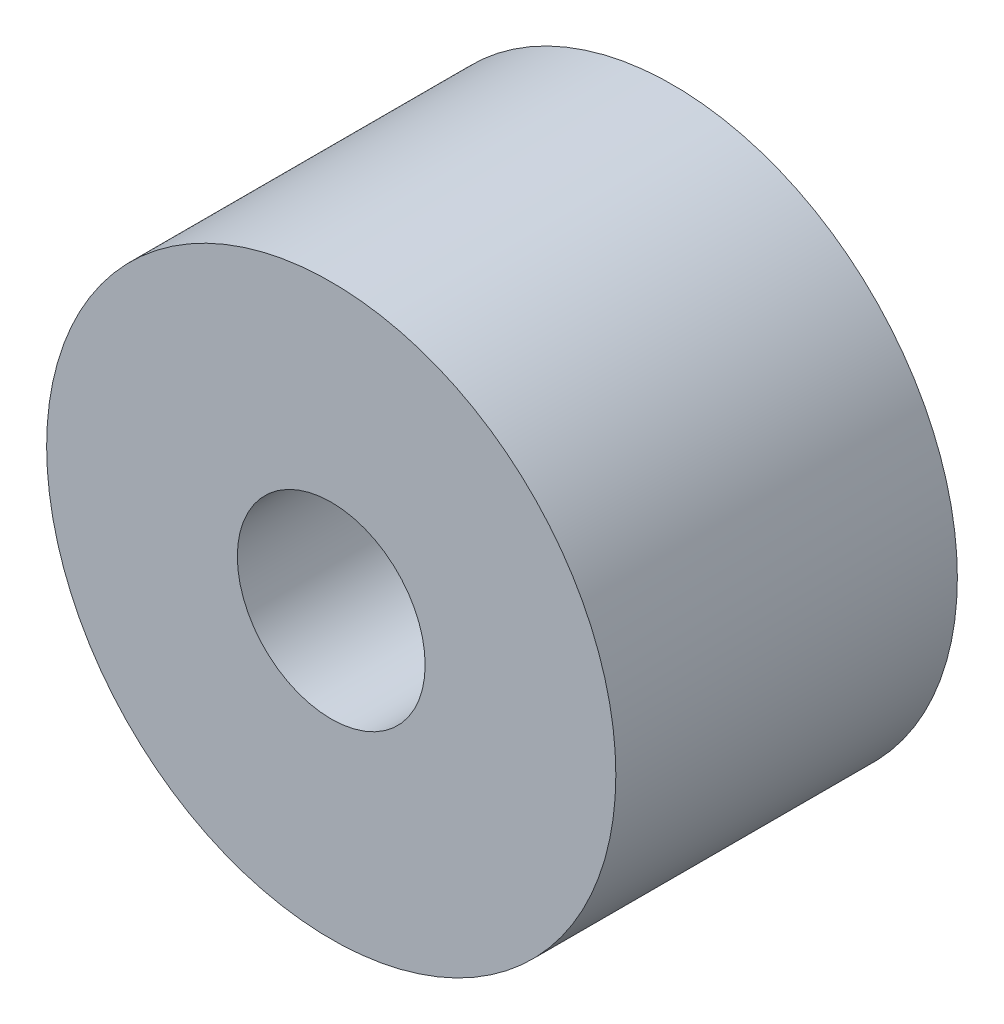
ISO-10303-21;
HEADER;
FILE_DESCRIPTION(('STEP AP214'),'2;1');
FILE_NAME('part.step','',(''),(''),'','','');
FILE_SCHEMA(('AUTOMOTIVE_DESIGN { 1 0 10303 214 1 1 1 1 }'));
ENDSEC;
DATA;
#1=APPLICATION_CONTEXT('core data for automotive mechanical design processes');
#2=APPLICATION_PROTOCOL_DEFINITION('international standard','automotive_design',2000,#1);
#3=PRODUCT_CONTEXT('',#1,'mechanical');
#4=PRODUCT('Part','Part','',(#3));
#5=PRODUCT_RELATED_PRODUCT_CATEGORY('part','',(#4));
#6=PRODUCT_DEFINITION_FORMATION('','',#4);
#7=PRODUCT_DEFINITION_CONTEXT('part definition',#1,'design');
#8=PRODUCT_DEFINITION('design','',#6,#7);
#9=PRODUCT_DEFINITION_SHAPE('','',#8);
#10=(LENGTH_UNIT() NAMED_UNIT(*) SI_UNIT(.MILLI.,.METRE.));
#11=(NAMED_UNIT(*) PLANE_ANGLE_UNIT() SI_UNIT($,.RADIAN.));
#12=(NAMED_UNIT(*) SI_UNIT($,.STERADIAN.) SOLID_ANGLE_UNIT());
#13=UNCERTAINTY_MEASURE_WITH_UNIT(LENGTH_MEASURE(1.E-05),#10,'distance_accuracy_value','');
#14=(GEOMETRIC_REPRESENTATION_CONTEXT(3) GLOBAL_UNCERTAINTY_ASSIGNED_CONTEXT((#13)) GLOBAL_UNIT_ASSIGNED_CONTEXT((#10,
#11,#12)) REPRESENTATION_CONTEXT('',''));
#15=CARTESIAN_POINT('',(0.,0.,0.));
#16=DIRECTION('',(0.,0.,1.));
#17=DIRECTION('',(1.,0.,0.));
#18=AXIS2_PLACEMENT_3D('',#15,#16,#17);
#19=CARTESIAN_POINT('',(0.,0.,3.));
#20=DIRECTION('',(0.,0.,1.));
#21=DIRECTION('',(1.,0.,0.));
#22=AXIS2_PLACEMENT_3D('',#19,#20,#21);
#23=PLANE('',#22);
#24=CARTESIAN_POINT('',(107.475477710304,63.1467705134049,3.));
#25=DIRECTION('',(0.,0.,1.));
#26=DIRECTION('',(1.,0.,0.));
#27=AXIS2_PLACEMENT_3D('',#24,#25,#26);
#28=CIRCLE('',#27,1.65);
#29=CARTESIAN_POINT('',(109.125477710304,63.1467705134049,3.));
#30=VERTEX_POINT('',#29);
#31=EDGE_CURVE('E10',#30,#30,#28,.T.);
#32=ORIENTED_EDGE('',*,*,#31,.F.);
#33=EDGE_LOOP('',(#32));
#34=FACE_BOUND('',#33,.T.);
#35=CARTESIAN_POINT('',(107.475477710304,63.1467705134049,3.));
#36=DIRECTION('',(0.,0.,1.));
#37=DIRECTION('',(1.,0.,0.));
#38=AXIS2_PLACEMENT_3D('',#35,#36,#37);
#39=CIRCLE('',#38,5.00000000000001);
#40=CARTESIAN_POINT('',(112.475477710304,63.1467705134049,3.));
#41=VERTEX_POINT('',#40);
#42=EDGE_CURVE('E48',#41,#41,#39,.T.);
#43=ORIENTED_EDGE('',*,*,#42,.T.);
#44=EDGE_LOOP('',(#43));
#45=FACE_BOUND('',#44,.T.);
#46=ADVANCED_FACE('F34',(#34,#45),#23,.T.);
#47=CARTESIAN_POINT('',(0.,0.,-3.));
#48=DIRECTION('',(0.,0.,1.));
#49=DIRECTION('',(1.,0.,0.));
#50=AXIS2_PLACEMENT_3D('',#47,#48,#49);
#51=PLANE('',#50);
#52=CARTESIAN_POINT('',(107.475477710304,63.1467705134049,-3.));
#53=DIRECTION('',(0.,0.,1.));
#54=DIRECTION('',(1.,0.,0.));
#55=AXIS2_PLACEMENT_3D('',#52,#53,#54);
#56=CIRCLE('',#55,1.65);
#57=CARTESIAN_POINT('',(109.125477710304,63.1467705134049,-3.));
#58=VERTEX_POINT('',#57);
#59=EDGE_CURVE('E42',#58,#58,#56,.T.);
#60=ORIENTED_EDGE('',*,*,#59,.T.);
#61=EDGE_LOOP('',(#60));
#62=FACE_BOUND('',#61,.T.);
#63=CARTESIAN_POINT('',(107.475477710304,63.1467705134049,-3.));
#64=DIRECTION('',(0.,0.,1.));
#65=DIRECTION('',(1.,0.,0.));
#66=AXIS2_PLACEMENT_3D('',#63,#64,#65);
#67=CIRCLE('',#66,5.00000000000001);
#68=CARTESIAN_POINT('',(112.475477710304,63.1467705134049,-3.));
#69=VERTEX_POINT('',#68);
#70=EDGE_CURVE('E38',#69,#69,#67,.T.);
#71=ORIENTED_EDGE('',*,*,#70,.F.);
#72=EDGE_LOOP('',(#71));
#73=FACE_BOUND('',#72,.T.);
#74=ADVANCED_FACE('F57',(#62,#73),#51,.F.);
#75=CARTESIAN_POINT('',(107.475477710304,63.1467705134049,3.));
#76=DIRECTION('',(0.,0.,-1.));
#77=DIRECTION('',(-1.,0.,0.));
#78=AXIS2_PLACEMENT_3D('',#75,#76,#77);
#79=CYLINDRICAL_SURFACE('',#78,1.65);
#80=ORIENTED_EDGE('',*,*,#31,.T.);
#81=EDGE_LOOP('',(#80));
#82=FACE_BOUND('',#81,.T.);
#83=ORIENTED_EDGE('',*,*,#59,.F.);
#84=EDGE_LOOP('',(#83));
#85=FACE_BOUND('',#84,.T.);
#86=ADVANCED_FACE('F36',(#82,#85),#79,.F.);
#87=CARTESIAN_POINT('',(107.475477710304,63.1467705134049,-7.));
#88=DIRECTION('',(0.,0.,1.));
#89=DIRECTION('',(1.,0.,0.));
#90=AXIS2_PLACEMENT_3D('',#87,#88,#89);
#91=CYLINDRICAL_SURFACE('',#90,5.00000000000001);
#92=ORIENTED_EDGE('',*,*,#42,.F.);
#93=EDGE_LOOP('',(#92));
#94=FACE_BOUND('',#93,.T.);
#95=ORIENTED_EDGE('',*,*,#70,.T.);
#96=EDGE_LOOP('',(#95));
#97=FACE_BOUND('',#96,.T.);
#98=ADVANCED_FACE('F55',(#94,#97),#91,.T.);
#99=CLOSED_SHELL('',(#46,#74,#86,#98));
#100=MANIFOLD_SOLID_BREP('B2',#99);
#101=ADVANCED_BREP_SHAPE_REPRESENTATION('',(#18,#100),#14);
#102=SHAPE_DEFINITION_REPRESENTATION(#9,#101);
ENDSEC;
END-ISO-10303-21;
